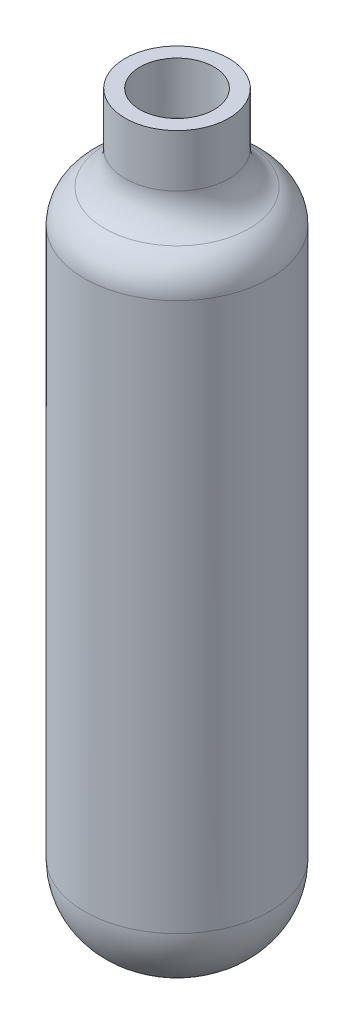
ISO-10303-21;
HEADER;
FILE_DESCRIPTION(('STEP AP214'),'2;1');
FILE_NAME('part.step','',(''),(''),'','','');
FILE_SCHEMA(('AUTOMOTIVE_DESIGN { 1 0 10303 214 1 1 1 1 }'));
ENDSEC;
DATA;
#1=APPLICATION_CONTEXT('core data for automotive mechanical design processes');
#2=APPLICATION_PROTOCOL_DEFINITION('international standard','automotive_design',2000,#1);
#3=PRODUCT_CONTEXT('',#1,'mechanical');
#4=PRODUCT('Part','Part','',(#3));
#5=PRODUCT_RELATED_PRODUCT_CATEGORY('part','',(#4));
#6=PRODUCT_DEFINITION_FORMATION('','',#4);
#7=PRODUCT_DEFINITION_CONTEXT('part definition',#1,'design');
#8=PRODUCT_DEFINITION('design','',#6,#7);
#9=PRODUCT_DEFINITION_SHAPE('','',#8);
#10=(LENGTH_UNIT() NAMED_UNIT(*) SI_UNIT(.MILLI.,.METRE.));
#11=(NAMED_UNIT(*) PLANE_ANGLE_UNIT() SI_UNIT($,.RADIAN.));
#12=(NAMED_UNIT(*) SI_UNIT($,.STERADIAN.) SOLID_ANGLE_UNIT());
#13=UNCERTAINTY_MEASURE_WITH_UNIT(LENGTH_MEASURE(1.E-05),#10,'distance_accuracy_value','');
#14=(GEOMETRIC_REPRESENTATION_CONTEXT(3) GLOBAL_UNCERTAINTY_ASSIGNED_CONTEXT((#13)) GLOBAL_UNIT_ASSIGNED_CONTEXT((#10,
#11,#12)) REPRESENTATION_CONTEXT('',''));
#15=CARTESIAN_POINT('',(0.,0.,0.));
#16=DIRECTION('',(0.,0.,1.));
#17=DIRECTION('',(1.,0.,0.));
#18=AXIS2_PLACEMENT_3D('',#15,#16,#17);
#19=CARTESIAN_POINT('',(0.,0.,0.));
#20=DIRECTION('',(0.,-1.,0.));
#21=DIRECTION('',(0.,0.,-1.));
#22=AXIS2_PLACEMENT_3D('',#19,#20,#21);
#23=PLANE('',#22);
#24=CARTESIAN_POINT('',(0.,0.,0.));
#25=DIRECTION('',(0.,-1.,0.));
#26=DIRECTION('',(0.,0.,-1.));
#27=AXIS2_PLACEMENT_3D('',#24,#25,#26);
#28=CIRCLE('',#27,5.);
#29=CARTESIAN_POINT('',(0.,0.,-5.));
#30=VERTEX_POINT('',#29);
#31=EDGE_CURVE('E69',#30,#30,#28,.T.);
#32=ORIENTED_EDGE('',*,*,#31,.T.);
#33=EDGE_LOOP('',(#32));
#34=FACE_BOUND('',#33,.T.);
#35=ADVANCED_FACE('F34',(#34),#23,.T.);
#36=CARTESIAN_POINT('',(0.,0.,0.));
#37=DIRECTION('',(0.,-1.,0.));
#38=DIRECTION('',(0.,0.,-1.));
#39=AXIS2_PLACEMENT_3D('',#36,#37,#38);
#40=CYLINDRICAL_SURFACE('',#39,25.);
#41=CARTESIAN_POINT('',(0.,168.,0.));
#42=DIRECTION('',(0.,1.,0.));
#43=DIRECTION('',(0.,0.,1.));
#44=AXIS2_PLACEMENT_3D('',#41,#42,#43);
#45=CIRCLE('',#44,25.);
#46=CARTESIAN_POINT('',(0.,168.,25.));
#47=VERTEX_POINT('',#46);
#48=EDGE_CURVE('E57',#47,#47,#45,.F.);
#49=ORIENTED_EDGE('',*,*,#48,.T.);
#50=EDGE_LOOP('',(#49));
#51=FACE_BOUND('',#50,.T.);
#52=CARTESIAN_POINT('',(0.,20.,0.));
#53=DIRECTION('',(0.,-1.,0.));
#54=DIRECTION('',(0.,0.,-1.));
#55=AXIS2_PLACEMENT_3D('',#52,#53,#54);
#56=CIRCLE('',#55,25.);
#57=CARTESIAN_POINT('',(0.,20.,-25.));
#58=VERTEX_POINT('',#57);
#59=EDGE_CURVE('E66',#58,#58,#56,.F.);
#60=ORIENTED_EDGE('',*,*,#59,.T.);
#61=EDGE_LOOP('',(#60));
#62=FACE_BOUND('',#61,.T.);
#63=ADVANCED_FACE('F97',(#51,#62),#40,.T.);
#64=CARTESIAN_POINT('',(0.,0.,0.));
#65=DIRECTION('',(0.,-1.,0.));
#66=DIRECTION('',(0.,0.,-1.));
#67=AXIS2_PLACEMENT_3D('',#64,#65,#66);
#68=CYLINDRICAL_SURFACE('',#67,14.);
#69=CARTESIAN_POINT('',(0.,185.860571099492,0.));
#70=DIRECTION('',(0.,-1.,0.));
#71=DIRECTION('',(0.,0.,-1.));
#72=AXIS2_PLACEMENT_3D('',#69,#70,#71);
#73=CIRCLE('',#72,14.);
#74=CARTESIAN_POINT('',(0.,185.860571099492,-14.));
#75=VERTEX_POINT('',#74);
#76=EDGE_CURVE('E10',#75,#75,#73,.F.);
#77=ORIENTED_EDGE('',*,*,#76,.T.);
#78=EDGE_LOOP('',(#77));
#79=FACE_BOUND('',#78,.T.);
#80=CARTESIAN_POINT('',(0.,200.,0.));
#81=DIRECTION('',(0.,-1.,0.));
#82=DIRECTION('',(0.,0.,-1.));
#83=AXIS2_PLACEMENT_3D('',#80,#81,#82);
#84=CIRCLE('',#83,14.);
#85=CARTESIAN_POINT('',(0.,200.,-14.));
#86=VERTEX_POINT('',#85);
#87=EDGE_CURVE('E72',#86,#86,#84,.T.);
#88=ORIENTED_EDGE('',*,*,#87,.T.);
#89=EDGE_LOOP('',(#88));
#90=FACE_BOUND('',#89,.T.);
#91=ADVANCED_FACE('F94',(#79,#90),#68,.T.);
#92=CARTESIAN_POINT('',(14.,200.,0.));
#93=DIRECTION('',(0.,1.,0.));
#94=DIRECTION('',(0.,0.,1.));
#95=AXIS2_PLACEMENT_3D('',#92,#93,#94);
#96=PLANE('',#95);
#97=CARTESIAN_POINT('',(0.,200.,0.));
#98=DIRECTION('',(0.,-1.,0.));
#99=DIRECTION('',(0.,0.,-1.));
#100=AXIS2_PLACEMENT_3D('',#97,#98,#99);
#101=CIRCLE('',#100,10.);
#102=CARTESIAN_POINT('',(0.,200.,-10.));
#103=VERTEX_POINT('',#102);
#104=EDGE_CURVE('E75',#103,#103,#101,.T.);
#105=ORIENTED_EDGE('',*,*,#104,.T.);
#106=EDGE_LOOP('',(#105));
#107=FACE_BOUND('',#106,.T.);
#108=ORIENTED_EDGE('',*,*,#87,.F.);
#109=EDGE_LOOP('',(#108));
#110=FACE_BOUND('',#109,.T.);
#111=ADVANCED_FACE('F79',(#107,#110),#96,.T.);
#112=CARTESIAN_POINT('',(0.,0.,0.));
#113=DIRECTION('',(0.,-1.,0.));
#114=DIRECTION('',(0.,0.,-1.));
#115=AXIS2_PLACEMENT_3D('',#112,#113,#114);
#116=CYLINDRICAL_SURFACE('',#115,10.);
#117=CARTESIAN_POINT('',(0.,186.078784028339,0.));
#118=DIRECTION('',(0.,1.,0.));
#119=DIRECTION('',(0.,0.,1.));
#120=AXIS2_PLACEMENT_3D('',#117,#118,#119);
#121=CIRCLE('',#120,10.);
#122=CARTESIAN_POINT('',(0.,186.078784028339,10.));
#123=VERTEX_POINT('',#122);
#124=EDGE_CURVE('E49',#123,#123,#121,.F.);
#125=ORIENTED_EDGE('',*,*,#124,.T.);
#126=EDGE_LOOP('',(#125));
#127=FACE_BOUND('',#126,.T.);
#128=ORIENTED_EDGE('',*,*,#104,.F.);
#129=EDGE_LOOP('',(#128));
#130=FACE_BOUND('',#129,.T.);
#131=ADVANCED_FACE('F82',(#127,#130),#116,.F.);
#132=CARTESIAN_POINT('',(0.,0.,0.));
#133=DIRECTION('',(0.,-1.,0.));
#134=DIRECTION('',(0.,0.,-1.));
#135=AXIS2_PLACEMENT_3D('',#132,#133,#134);
#136=CYLINDRICAL_SURFACE('',#135,24.);
#137=CARTESIAN_POINT('',(0.,167.,0.));
#138=DIRECTION('',(0.,-1.,0.));
#139=DIRECTION('',(0.,0.,-1.));
#140=AXIS2_PLACEMENT_3D('',#137,#138,#139);
#141=CIRCLE('',#140,24.);
#142=CARTESIAN_POINT('',(0.,167.,-24.));
#143=VERTEX_POINT('',#142);
#144=EDGE_CURVE('E54',#143,#143,#141,.F.);
#145=ORIENTED_EDGE('',*,*,#144,.T.);
#146=EDGE_LOOP('',(#145));
#147=FACE_BOUND('',#146,.T.);
#148=CARTESIAN_POINT('',(0.,21.,0.));
#149=DIRECTION('',(0.,1.,0.));
#150=DIRECTION('',(0.,0.,1.));
#151=AXIS2_PLACEMENT_3D('',#148,#149,#150);
#152=CIRCLE('',#151,24.);
#153=CARTESIAN_POINT('',(0.,21.,24.));
#154=VERTEX_POINT('',#153);
#155=EDGE_CURVE('E63',#154,#154,#152,.F.);
#156=ORIENTED_EDGE('',*,*,#155,.T.);
#157=EDGE_LOOP('',(#156));
#158=FACE_BOUND('',#157,.T.);
#159=ADVANCED_FACE('F84',(#147,#158),#136,.F.);
#160=CARTESIAN_POINT('',(0.,1.,0.));
#161=DIRECTION('',(0.,1.,0.));
#162=DIRECTION('',(0.,0.,1.));
#163=AXIS2_PLACEMENT_3D('',#160,#161,#162);
#164=PLANE('',#163);
#165=CARTESIAN_POINT('',(0.,1.,0.));
#166=DIRECTION('',(0.,1.,0.));
#167=DIRECTION('',(0.,0.,1.));
#168=AXIS2_PLACEMENT_3D('',#165,#166,#167);
#169=CIRCLE('',#168,4.);
#170=CARTESIAN_POINT('',(0.,1.,4.));
#171=VERTEX_POINT('',#170);
#172=EDGE_CURVE('E60',#171,#171,#169,.T.);
#173=ORIENTED_EDGE('',*,*,#172,.T.);
#174=EDGE_LOOP('',(#173));
#175=FACE_BOUND('',#174,.T.);
#176=ADVANCED_FACE('F91',(#175),#164,.T.);
#177=CARTESIAN_POINT('',(0.,20.,0.));
#178=DIRECTION('',(0.,-1.,0.));
#179=DIRECTION('',(0.,0.,-1.));
#180=AXIS2_PLACEMENT_3D('',#177,#178,#179);
#181=DEGENERATE_TOROIDAL_SURFACE('',#180,5.,20.,.T.);
#182=ORIENTED_EDGE('',*,*,#59,.F.);
#183=EDGE_LOOP('',(#182));
#184=FACE_BOUND('',#183,.T.);
#185=ORIENTED_EDGE('',*,*,#31,.F.);
#186=EDGE_LOOP('',(#185));
#187=FACE_BOUND('',#186,.T.);
#188=ADVANCED_FACE('F107',(#184,#187),#181,.T.);
#189=CARTESIAN_POINT('',(0.,21.,0.));
#190=DIRECTION('',(0.,1.,0.));
#191=DIRECTION('',(0.,0.,1.));
#192=AXIS2_PLACEMENT_3D('',#189,#190,#191);
#193=DEGENERATE_TOROIDAL_SURFACE('',#192,4.,20.,.T.);
#194=ORIENTED_EDGE('',*,*,#172,.F.);
#195=EDGE_LOOP('',(#194));
#196=FACE_BOUND('',#195,.T.);
#197=ORIENTED_EDGE('',*,*,#155,.F.);
#198=EDGE_LOOP('',(#197));
#199=FACE_BOUND('',#198,.T.);
#200=ADVANCED_FACE('F110',(#196,#199),#193,.F.);
#201=CARTESIAN_POINT('',(0.,168.,0.));
#202=DIRECTION('',(0.,1.,0.));
#203=DIRECTION('',(0.,0.,1.));
#204=AXIS2_PLACEMENT_3D('',#201,#202,#203);
#205=TOROIDAL_SURFACE('',#204,15.,10.);
#206=CARTESIAN_POINT('',(0.,176.930285549746,0.));
#207=DIRECTION('',(0.,-1.,0.));
#208=DIRECTION('',(0.,0.,-1.));
#209=AXIS2_PLACEMENT_3D('',#206,#207,#208);
#210=CIRCLE('',#209,19.5);
#211=CARTESIAN_POINT('',(0.,176.930285549746,-19.5));
#212=VERTEX_POINT('',#211);
#213=EDGE_CURVE('E41',#212,#212,#210,.T.);
#214=ORIENTED_EDGE('',*,*,#213,.T.);
#215=EDGE_LOOP('',(#214));
#216=FACE_BOUND('',#215,.T.);
#217=ORIENTED_EDGE('',*,*,#48,.F.);
#218=EDGE_LOOP('',(#217));
#219=FACE_BOUND('',#218,.T.);
#220=ADVANCED_FACE('F114',(#216,#219),#205,.T.);
#221=CARTESIAN_POINT('',(0.,167.,0.));
#222=DIRECTION('',(0.,-1.,0.));
#223=DIRECTION('',(0.,0.,-1.));
#224=AXIS2_PLACEMENT_3D('',#221,#222,#223);
#225=TOROIDAL_SURFACE('',#224,14.,10.);
#226=CARTESIAN_POINT('',(0.,176.539392014169,0.));
#227=DIRECTION('',(0.,-1.,0.));
#228=DIRECTION('',(0.,0.,-1.));
#229=AXIS2_PLACEMENT_3D('',#226,#227,#228);
#230=CIRCLE('',#229,17.);
#231=CARTESIAN_POINT('',(0.,176.539392014169,-17.));
#232=VERTEX_POINT('',#231);
#233=EDGE_CURVE('E45',#232,#232,#230,.F.);
#234=ORIENTED_EDGE('',*,*,#233,.T.);
#235=EDGE_LOOP('',(#234));
#236=FACE_BOUND('',#235,.T.);
#237=ORIENTED_EDGE('',*,*,#144,.F.);
#238=EDGE_LOOP('',(#237));
#239=FACE_BOUND('',#238,.T.);
#240=ADVANCED_FACE('F118',(#236,#239),#225,.F.);
#241=CARTESIAN_POINT('',(0.,186.078784028339,0.));
#242=DIRECTION('',(0.,1.,0.));
#243=DIRECTION('',(0.,0.,1.));
#244=AXIS2_PLACEMENT_3D('',#241,#242,#243);
#245=TOROIDAL_SURFACE('',#244,20.,10.);
#246=ORIENTED_EDGE('',*,*,#233,.F.);
#247=EDGE_LOOP('',(#246));
#248=FACE_BOUND('',#247,.T.);
#249=ORIENTED_EDGE('',*,*,#124,.F.);
#250=EDGE_LOOP('',(#249));
#251=FACE_BOUND('',#250,.T.);
#252=ADVANCED_FACE('F120',(#248,#251),#245,.T.);
#253=CARTESIAN_POINT('',(0.,185.860571099492,0.));
#254=DIRECTION('',(0.,-1.,0.));
#255=DIRECTION('',(0.,0.,-1.));
#256=AXIS2_PLACEMENT_3D('',#253,#254,#255);
#257=TOROIDAL_SURFACE('',#256,24.,10.);
#258=ORIENTED_EDGE('',*,*,#76,.F.);
#259=EDGE_LOOP('',(#258));
#260=FACE_BOUND('',#259,.T.);
#261=ORIENTED_EDGE('',*,*,#213,.F.);
#262=EDGE_LOOP('',(#261));
#263=FACE_BOUND('',#262,.T.);
#264=ADVANCED_FACE('F36',(#260,#263),#257,.F.);
#265=CLOSED_SHELL('',(#35,#63,#91,#111,#131,#159,#176,#188,#200,#220,#240,#252,#264));
#266=MANIFOLD_SOLID_BREP('B2',#265);
#267=ADVANCED_BREP_SHAPE_REPRESENTATION('',(#18,#266),#14);
#268=SHAPE_DEFINITION_REPRESENTATION(#9,#267);
ENDSEC;
END-ISO-10303-21;
